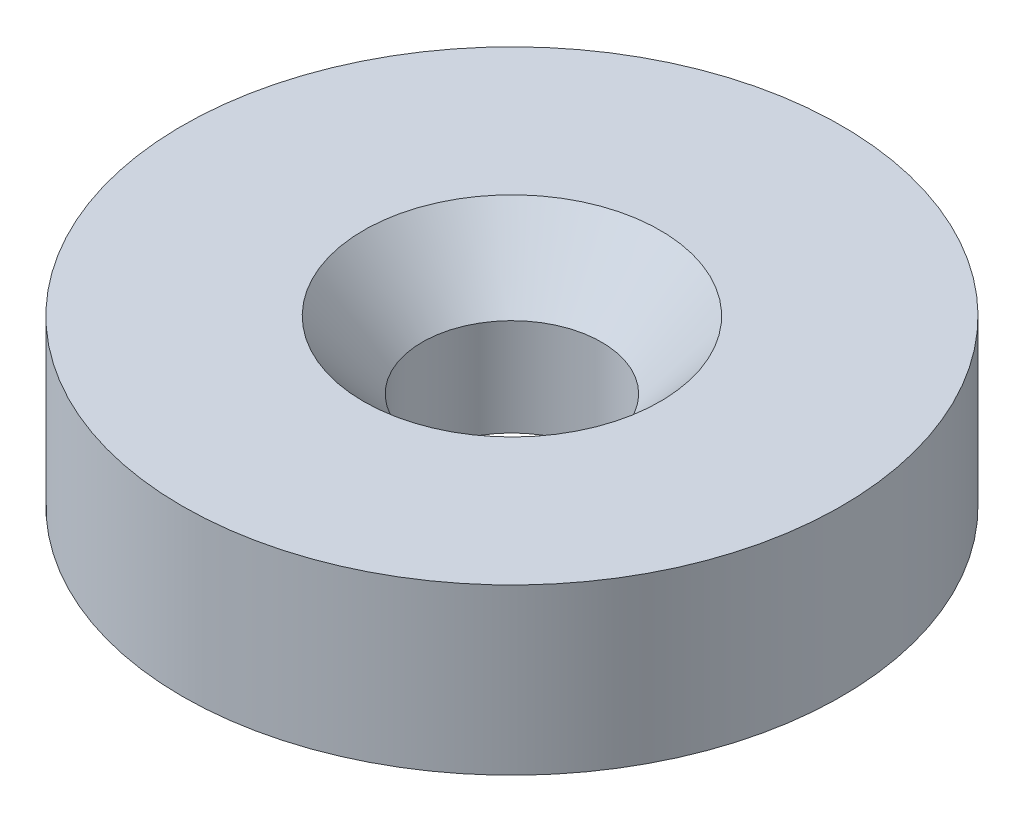
ISO-10303-21;
HEADER;
FILE_DESCRIPTION(('STEP AP214'),'2;1');
FILE_NAME('part.step','',(''),(''),'','','');
FILE_SCHEMA(('AUTOMOTIVE_DESIGN { 1 0 10303 214 1 1 1 1 }'));
ENDSEC;
DATA;
#1=APPLICATION_CONTEXT('core data for automotive mechanical design processes');
#2=APPLICATION_PROTOCOL_DEFINITION('international standard','automotive_design',2000,#1);
#3=PRODUCT_CONTEXT('',#1,'mechanical');
#4=PRODUCT('Part','Part','',(#3));
#5=PRODUCT_RELATED_PRODUCT_CATEGORY('part','',(#4));
#6=PRODUCT_DEFINITION_FORMATION('','',#4);
#7=PRODUCT_DEFINITION_CONTEXT('part definition',#1,'design');
#8=PRODUCT_DEFINITION('design','',#6,#7);
#9=PRODUCT_DEFINITION_SHAPE('','',#8);
#10=(LENGTH_UNIT() NAMED_UNIT(*) SI_UNIT(.MILLI.,.METRE.));
#11=(NAMED_UNIT(*) PLANE_ANGLE_UNIT() SI_UNIT($,.RADIAN.));
#12=(NAMED_UNIT(*) SI_UNIT($,.STERADIAN.) SOLID_ANGLE_UNIT());
#13=UNCERTAINTY_MEASURE_WITH_UNIT(LENGTH_MEASURE(1.E-05),#10,'distance_accuracy_value','');
#14=(GEOMETRIC_REPRESENTATION_CONTEXT(3) GLOBAL_UNCERTAINTY_ASSIGNED_CONTEXT((#13)) GLOBAL_UNIT_ASSIGNED_CONTEXT((#10,
#11,#12)) REPRESENTATION_CONTEXT('',''));
#15=CARTESIAN_POINT('',(0.,0.,0.));
#16=DIRECTION('',(0.,0.,1.));
#17=DIRECTION('',(1.,0.,0.));
#18=AXIS2_PLACEMENT_3D('',#15,#16,#17);
#19=CARTESIAN_POINT('',(0.,3.175,0.));
#20=DIRECTION('',(0.,-1.,0.));
#21=DIRECTION('',(0.,0.,-1.));
#22=AXIS2_PLACEMENT_3D('',#19,#20,#21);
#23=CYLINDRICAL_SURFACE('',#22,6.35);
#24=CARTESIAN_POINT('',(0.,3.175,0.));
#25=DIRECTION('',(0.,1.,0.));
#26=DIRECTION('',(0.,0.,1.));
#27=AXIS2_PLACEMENT_3D('',#24,#25,#26);
#28=CIRCLE('',#27,6.35);
#29=CARTESIAN_POINT('',(0.,3.175,6.35));
#30=VERTEX_POINT('',#29);
#31=EDGE_CURVE('E10',#30,#30,#28,.T.);
#32=ORIENTED_EDGE('',*,*,#31,.F.);
#33=EDGE_LOOP('',(#32));
#34=FACE_BOUND('',#33,.T.);
#35=CARTESIAN_POINT('',(0.,0.,0.));
#36=DIRECTION('',(0.,1.,0.));
#37=DIRECTION('',(0.,0.,1.));
#38=AXIS2_PLACEMENT_3D('',#35,#36,#37);
#39=CIRCLE('',#38,6.35);
#40=CARTESIAN_POINT('',(0.,0.,6.35));
#41=VERTEX_POINT('',#40);
#42=EDGE_CURVE('E35',#41,#41,#39,.T.);
#43=ORIENTED_EDGE('',*,*,#42,.T.);
#44=EDGE_LOOP('',(#43));
#45=FACE_BOUND('',#44,.T.);
#46=ADVANCED_FACE('F32',(#34,#45),#23,.T.);
#47=CARTESIAN_POINT('',(0.,3.175,0.));
#48=DIRECTION('',(0.,1.,0.));
#49=DIRECTION('',(0.,0.,1.));
#50=AXIS2_PLACEMENT_3D('',#47,#48,#49);
#51=PLANE('',#50);
#52=CARTESIAN_POINT('',(0.,3.175,0.));
#53=DIRECTION('',(0.,1.,0.));
#54=DIRECTION('',(0.,0.,1.));
#55=AXIS2_PLACEMENT_3D('',#52,#53,#54);
#56=CIRCLE('',#55,2.8575);
#57=CARTESIAN_POINT('',(0.,3.175,2.8575));
#58=VERTEX_POINT('',#57);
#59=EDGE_CURVE('E49',#58,#58,#56,.T.);
#60=ORIENTED_EDGE('',*,*,#59,.F.);
#61=EDGE_LOOP('',(#60));
#62=FACE_BOUND('',#61,.T.);
#63=ORIENTED_EDGE('',*,*,#31,.T.);
#64=EDGE_LOOP('',(#63));
#65=FACE_BOUND('',#64,.T.);
#66=ADVANCED_FACE('F55',(#62,#65),#51,.T.);
#67=CARTESIAN_POINT('',(0.,0.,0.));
#68=DIRECTION('',(0.,1.,0.));
#69=DIRECTION('',(0.,0.,1.));
#70=AXIS2_PLACEMENT_3D('',#67,#68,#69);
#71=PLANE('',#70);
#72=CARTESIAN_POINT('',(0.,0.,0.));
#73=DIRECTION('',(0.,1.,0.));
#74=DIRECTION('',(0.,0.,1.));
#75=AXIS2_PLACEMENT_3D('',#72,#73,#74);
#76=CIRCLE('',#75,1.7272);
#77=CARTESIAN_POINT('',(0.,0.,1.7272));
#78=VERTEX_POINT('',#77);
#79=EDGE_CURVE('E42',#78,#78,#76,.T.);
#80=ORIENTED_EDGE('',*,*,#79,.T.);
#81=EDGE_LOOP('',(#80));
#82=FACE_BOUND('',#81,.T.);
#83=ORIENTED_EDGE('',*,*,#42,.F.);
#84=EDGE_LOOP('',(#83));
#85=FACE_BOUND('',#84,.T.);
#86=ADVANCED_FACE('F57',(#82,#85),#71,.F.);
#87=CARTESIAN_POINT('',(0.,3.175,0.));
#88=DIRECTION('',(0.,1.,0.));
#89=DIRECTION('',(0.,0.,1.));
#90=AXIS2_PLACEMENT_3D('',#87,#88,#89);
#91=CYLINDRICAL_SURFACE('',#90,1.7272);
#92=ORIENTED_EDGE('',*,*,#79,.F.);
#93=EDGE_LOOP('',(#92));
#94=FACE_BOUND('',#93,.T.);
#95=CARTESIAN_POINT('',(0.,1.87473858931809,0.));
#96=DIRECTION('',(0.,1.,0.));
#97=DIRECTION('',(0.,0.,1.));
#98=AXIS2_PLACEMENT_3D('',#95,#96,#97);
#99=CIRCLE('',#98,1.7272);
#100=CARTESIAN_POINT('',(0.,1.87473858931809,1.7272));
#101=VERTEX_POINT('',#100);
#102=EDGE_CURVE('E46',#101,#101,#99,.T.);
#103=ORIENTED_EDGE('',*,*,#102,.T.);
#104=EDGE_LOOP('',(#103));
#105=FACE_BOUND('',#104,.T.);
#106=ADVANCED_FACE('F63',(#94,#105),#91,.F.);
#107=CARTESIAN_POINT('',(0.,3.175,0.));
#108=DIRECTION('',(0.,1.,0.));
#109=DIRECTION('',(0.,0.,1.));
#110=AXIS2_PLACEMENT_3D('',#107,#108,#109);
#111=CONICAL_SURFACE('',#110,2.8575,0.715584993317675);
#112=ORIENTED_EDGE('',*,*,#102,.F.);
#113=EDGE_LOOP('',(#112));
#114=FACE_BOUND('',#113,.T.);
#115=ORIENTED_EDGE('',*,*,#59,.T.);
#116=EDGE_LOOP('',(#115));
#117=FACE_BOUND('',#116,.T.);
#118=ADVANCED_FACE('F53',(#114,#117),#111,.F.);
#119=CLOSED_SHELL('',(#46,#66,#86,#106,#118));
#120=MANIFOLD_SOLID_BREP('B2',#119);
#121=ADVANCED_BREP_SHAPE_REPRESENTATION('',(#18,#120),#14);
#122=SHAPE_DEFINITION_REPRESENTATION(#9,#121);
ENDSEC;
END-ISO-10303-21;
